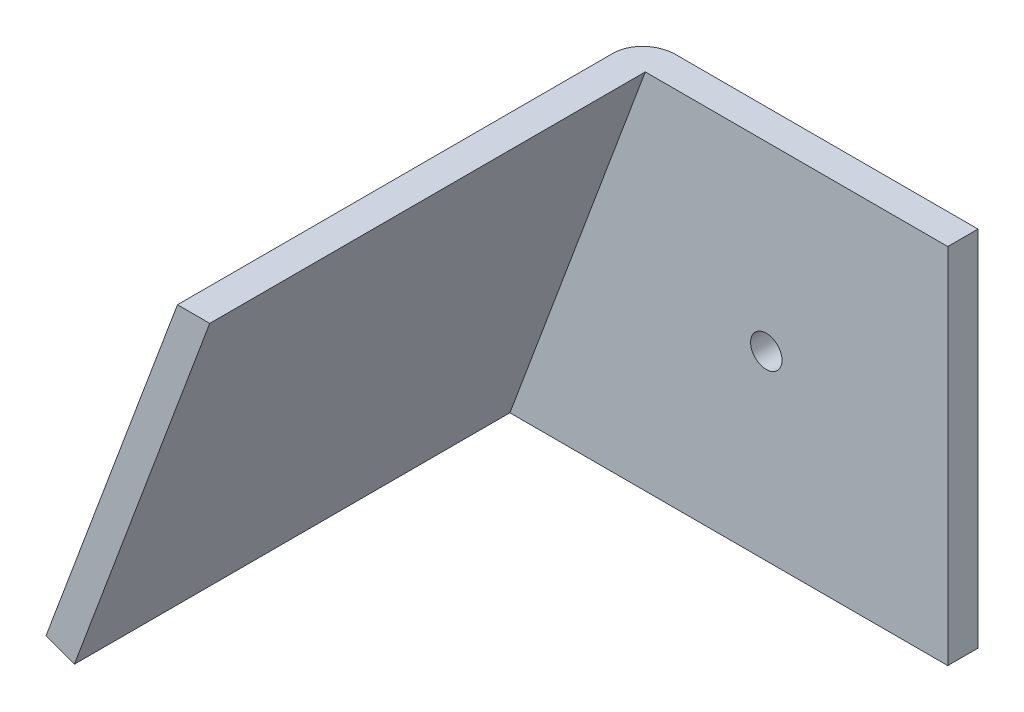
ISO-10303-21;
HEADER;
FILE_DESCRIPTION(('STEP AP214'),'2;1');
FILE_NAME('part.step','',(''),(''),'','','');
FILE_SCHEMA(('AUTOMOTIVE_DESIGN { 1 0 10303 214 1 1 1 1 }'));
ENDSEC;
DATA;
#1=APPLICATION_CONTEXT('core data for automotive mechanical design processes');
#2=APPLICATION_PROTOCOL_DEFINITION('international standard','automotive_design',2000,#1);
#3=PRODUCT_CONTEXT('',#1,'mechanical');
#4=PRODUCT('Part','Part','',(#3));
#5=PRODUCT_RELATED_PRODUCT_CATEGORY('part','',(#4));
#6=PRODUCT_DEFINITION_FORMATION('','',#4);
#7=PRODUCT_DEFINITION_CONTEXT('part definition',#1,'design');
#8=PRODUCT_DEFINITION('design','',#6,#7);
#9=PRODUCT_DEFINITION_SHAPE('','',#8);
#10=(LENGTH_UNIT() NAMED_UNIT(*) SI_UNIT(.MILLI.,.METRE.));
#11=(NAMED_UNIT(*) PLANE_ANGLE_UNIT() SI_UNIT($,.RADIAN.));
#12=(NAMED_UNIT(*) SI_UNIT($,.STERADIAN.) SOLID_ANGLE_UNIT());
#13=UNCERTAINTY_MEASURE_WITH_UNIT(LENGTH_MEASURE(1.E-05),#10,'distance_accuracy_value','');
#14=(GEOMETRIC_REPRESENTATION_CONTEXT(3) GLOBAL_UNCERTAINTY_ASSIGNED_CONTEXT((#13)) GLOBAL_UNIT_ASSIGNED_CONTEXT((#10,
#11,#12)) REPRESENTATION_CONTEXT('',''));
#15=CARTESIAN_POINT('',(0.,0.,0.));
#16=DIRECTION('',(0.,0.,1.));
#17=DIRECTION('',(1.,0.,0.));
#18=AXIS2_PLACEMENT_3D('',#15,#16,#17);
#19=CARTESIAN_POINT('',(-31.75,0.,-3.175));
#20=DIRECTION('',(0.,1.,0.));
#21=DIRECTION('',(0.,0.,1.));
#22=AXIS2_PLACEMENT_3D('',#19,#20,#21);
#23=PLANE('',#22);
#24=DIRECTION('',(-1.,0.,0.));
#25=VECTOR('',#24,1.);
#26=CARTESIAN_POINT('',(-31.75,0.,0.));
#27=LINE('',#26,#25);
#28=CARTESIAN_POINT('',(0.,0.,0.));
#29=VERTEX_POINT('',#28);
#30=CARTESIAN_POINT('',(-31.75,0.,0.));
#31=VERTEX_POINT('',#30);
#32=EDGE_CURVE('E121',#29,#31,#27,.T.);
#33=ORIENTED_EDGE('',*,*,#32,.F.);
#34=DIRECTION('',(0.,0.,1.));
#35=VECTOR('',#34,1.);
#36=CARTESIAN_POINT('',(0.,0.,-3.175));
#37=LINE('',#36,#35);
#38=CARTESIAN_POINT('',(0.,0.,-3.175));
#39=VERTEX_POINT('',#38);
#40=EDGE_CURVE('E11',#39,#29,#37,.T.);
#41=ORIENTED_EDGE('',*,*,#40,.F.);
#42=DIRECTION('',(-1.,0.,0.));
#43=VECTOR('',#42,1.);
#44=CARTESIAN_POINT('',(-31.75,0.,-3.175));
#45=LINE('',#44,#43);
#46=CARTESIAN_POINT('',(-31.75,0.,-3.175));
#47=VERTEX_POINT('',#46);
#48=EDGE_CURVE('E119',#39,#47,#45,.T.);
#49=ORIENTED_EDGE('',*,*,#48,.T.);
#50=CARTESIAN_POINT('',(-31.75,0.,0.));
#51=DIRECTION('',(0.,-1.,0.));
#52=DIRECTION('',(1.,0.,0.));
#53=AXIS2_PLACEMENT_3D('',#50,#51,#52);
#54=ELLIPSE('',#53,3.3887760149351,3.175);
#55=CARTESIAN_POINT('',(-35.1387760149353,0.,0.));
#56=VERTEX_POINT('',#55);
#57=EDGE_CURVE('E104',#47,#56,#54,.F.);
#58=ORIENTED_EDGE('',*,*,#57,.T.);
#59=DIRECTION('',(0.,0.,1.));
#60=VECTOR('',#59,1.);
#61=CARTESIAN_POINT('',(-35.1387760149353,0.,-5.588));
#62=LINE('',#61,#60);
#63=CARTESIAN_POINT('',(-35.1387760149353,0.,45.72));
#64=VERTEX_POINT('',#63);
#65=EDGE_CURVE('E306',#56,#64,#62,.T.);
#66=ORIENTED_EDGE('',*,*,#65,.T.);
#67=DIRECTION('',(-1.,0.,0.));
#68=VECTOR('',#67,1.);
#69=CARTESIAN_POINT('',(-34.7247097345983,0.,45.72));
#70=LINE('',#69,#68);
#71=CARTESIAN_POINT('',(-31.7500000000002,0.,45.72));
#72=VERTEX_POINT('',#71);
#73=EDGE_CURVE('E112',#72,#64,#70,.T.);
#74=ORIENTED_EDGE('',*,*,#73,.F.);
#75=DIRECTION('',(0.,0.,-1.));
#76=VECTOR('',#75,1.);
#77=CARTESIAN_POINT('',(-31.75,0.,0.));
#78=LINE('',#77,#76);
#79=EDGE_CURVE('E146',#72,#31,#78,.T.);
#80=ORIENTED_EDGE('',*,*,#79,.T.);
#81=EDGE_LOOP('',(#33,#41,#49,#58,#66,#74,#80));
#82=FACE_BOUND('',#81,.T.);
#83=ADVANCED_FACE('F39',(#82),#23,.T.);
#84=CARTESIAN_POINT('',(0.,-38.1,-3.175));
#85=DIRECTION('',(1.,0.,0.));
#86=DIRECTION('',(0.,0.,-1.));
#87=AXIS2_PLACEMENT_3D('',#84,#85,#86);
#88=PLANE('',#87);
#89=DIRECTION('',(0.,1.,0.));
#90=VECTOR('',#89,1.);
#91=CARTESIAN_POINT('',(0.,-38.1,0.));
#92=LINE('',#91,#90);
#93=CARTESIAN_POINT('',(0.,-38.1,0.));
#94=VERTEX_POINT('',#93);
#95=EDGE_CURVE('E134',#94,#29,#92,.T.);
#96=ORIENTED_EDGE('',*,*,#95,.F.);
#97=DIRECTION('',(0.,0.,1.));
#98=VECTOR('',#97,1.);
#99=CARTESIAN_POINT('',(0.,-38.1,-3.175));
#100=LINE('',#99,#98);
#101=CARTESIAN_POINT('',(0.,-38.1,-3.175));
#102=VERTEX_POINT('',#101);
#103=EDGE_CURVE('E49',#102,#94,#100,.T.);
#104=ORIENTED_EDGE('',*,*,#103,.F.);
#105=DIRECTION('',(0.,1.,0.));
#106=VECTOR('',#105,1.);
#107=CARTESIAN_POINT('',(0.,-38.1,-3.175));
#108=LINE('',#107,#106);
#109=EDGE_CURVE('E123',#102,#39,#108,.T.);
#110=ORIENTED_EDGE('',*,*,#109,.T.);
#111=ORIENTED_EDGE('',*,*,#40,.T.);
#112=EDGE_LOOP('',(#96,#104,#110,#111));
#113=FACE_BOUND('',#112,.T.);
#114=ADVANCED_FACE('F181',(#113),#88,.T.);
#115=CARTESIAN_POINT('',(-45.9646971347795,-38.1,-3.175));
#116=DIRECTION('',(0.,-1.,0.));
#117=DIRECTION('',(0.,0.,-1.));
#118=AXIS2_PLACEMENT_3D('',#115,#116,#117);
#119=PLANE('',#118);
#120=DIRECTION('',(1.,0.,0.));
#121=VECTOR('',#120,1.);
#122=CARTESIAN_POINT('',(-45.9646971347795,-38.1,0.));
#123=LINE('',#122,#121);
#124=CARTESIAN_POINT('',(-45.9646971347795,-38.1,0.));
#125=VERTEX_POINT('',#124);
#126=EDGE_CURVE('E130',#125,#94,#123,.T.);
#127=ORIENTED_EDGE('',*,*,#126,.F.);
#128=DIRECTION('',(0.,0.,1.));
#129=VECTOR('',#128,1.);
#130=CARTESIAN_POINT('',(-45.9646971347795,-38.1,-3.175));
#131=LINE('',#130,#129);
#132=CARTESIAN_POINT('',(-45.9646971347795,-38.1,-3.175));
#133=VERTEX_POINT('',#132);
#134=EDGE_CURVE('E43',#133,#125,#131,.T.);
#135=ORIENTED_EDGE('',*,*,#134,.F.);
#136=DIRECTION('',(1.,0.,0.));
#137=VECTOR('',#136,1.);
#138=CARTESIAN_POINT('',(-45.9646971347795,-38.1,-3.175));
#139=LINE('',#138,#137);
#140=EDGE_CURVE('E120',#133,#102,#139,.T.);
#141=ORIENTED_EDGE('',*,*,#140,.T.);
#142=ORIENTED_EDGE('',*,*,#103,.T.);
#143=EDGE_LOOP('',(#127,#135,#141,#142));
#144=FACE_BOUND('',#143,.T.);
#145=ADVANCED_FACE('F41',(#144),#119,.T.);
#146=CARTESIAN_POINT('',(0.,0.,-3.175));
#147=DIRECTION('',(0.,0.,1.));
#148=DIRECTION('',(1.,0.,0.));
#149=AXIS2_PLACEMENT_3D('',#146,#147,#148);
#150=PLANE('',#149);
#151=CARTESIAN_POINT('',(-19.05,-19.05,-3.175));
#152=DIRECTION('',(0.,0.,1.));
#153=DIRECTION('',(1.,0.,0.));
#154=AXIS2_PLACEMENT_3D('',#151,#152,#153);
#155=CIRCLE('',#154,1.651);
#156=CARTESIAN_POINT('',(-17.399,-19.05,-3.175));
#157=VERTEX_POINT('',#156);
#158=EDGE_CURVE('E131',#157,#157,#155,.T.);
#159=ORIENTED_EDGE('',*,*,#158,.T.);
#160=EDGE_LOOP('',(#159));
#161=FACE_BOUND('',#160,.T.);
#162=DIRECTION('',(-0.349553375420609,-0.936916451841923,0.));
#163=VECTOR('',#162,1.);
#164=CARTESIAN_POINT('',(-31.75,0.,-3.175));
#165=LINE('',#164,#163);
#166=EDGE_CURVE('E107',#47,#133,#165,.T.);
#167=ORIENTED_EDGE('',*,*,#166,.F.);
#168=ORIENTED_EDGE('',*,*,#48,.F.);
#169=ORIENTED_EDGE('',*,*,#109,.F.);
#170=ORIENTED_EDGE('',*,*,#140,.F.);
#171=EDGE_LOOP('',(#167,#168,#169,#170));
#172=FACE_BOUND('',#171,.T.);
#173=ADVANCED_FACE('F117',(#161,#172),#150,.F.);
#174=CARTESIAN_POINT('',(0.,0.,0.));
#175=DIRECTION('',(0.,0.,1.));
#176=DIRECTION('',(1.,0.,0.));
#177=AXIS2_PLACEMENT_3D('',#174,#175,#176);
#178=PLANE('',#177);
#179=CARTESIAN_POINT('',(-19.05,-19.05,0.));
#180=DIRECTION('',(0.,0.,1.));
#181=DIRECTION('',(1.,0.,0.));
#182=AXIS2_PLACEMENT_3D('',#179,#180,#181);
#183=CIRCLE('',#182,1.651);
#184=CARTESIAN_POINT('',(-17.399,-19.05,0.));
#185=VERTEX_POINT('',#184);
#186=EDGE_CURVE('E160',#185,#185,#183,.T.);
#187=ORIENTED_EDGE('',*,*,#186,.F.);
#188=EDGE_LOOP('',(#187));
#189=FACE_BOUND('',#188,.T.);
#190=DIRECTION('',(-0.349553375420609,-0.936916451841923,0.));
#191=VECTOR('',#190,1.);
#192=CARTESIAN_POINT('',(-31.75,0.,0.));
#193=LINE('',#192,#191);
#194=EDGE_CURVE('E128',#31,#125,#193,.T.);
#195=ORIENTED_EDGE('',*,*,#194,.T.);
#196=ORIENTED_EDGE('',*,*,#126,.T.);
#197=ORIENTED_EDGE('',*,*,#95,.T.);
#198=ORIENTED_EDGE('',*,*,#32,.T.);
#199=EDGE_LOOP('',(#195,#196,#197,#198));
#200=FACE_BOUND('',#199,.T.);
#201=ADVANCED_FACE('F140',(#189,#200),#178,.T.);
#202=CARTESIAN_POINT('',(-19.05,-19.05,-3.175));
#203=DIRECTION('',(0.,0.,1.));
#204=DIRECTION('',(1.,0.,0.));
#205=AXIS2_PLACEMENT_3D('',#202,#203,#204);
#206=CYLINDRICAL_SURFACE('',#205,1.651);
#207=ORIENTED_EDGE('',*,*,#158,.F.);
#208=EDGE_LOOP('',(#207));
#209=FACE_BOUND('',#208,.T.);
#210=ORIENTED_EDGE('',*,*,#186,.T.);
#211=EDGE_LOOP('',(#210));
#212=FACE_BOUND('',#211,.T.);
#213=ADVANCED_FACE('F171',(#209,#212),#206,.F.);
#214=CARTESIAN_POINT('',(-45.9646971347795,-38.1,-3.175));
#215=DIRECTION('',(-0.349553375420609,-0.936916451841923,0.));
#216=DIRECTION('',(0.936916451841923,-0.349553375420609,0.));
#217=AXIS2_PLACEMENT_3D('',#214,#215,#216);
#218=PLANE('',#217);
#219=CARTESIAN_POINT('',(-45.9646971347795,-38.1,0.));
#220=DIRECTION('',(0.349553375420609,0.936916451841923,0.));
#221=DIRECTION('',(-0.936916451841923,0.349553375420609,0.));
#222=AXIS2_PLACEMENT_3D('',#219,#220,#221);
#223=CIRCLE('',#222,3.175);
#224=CARTESIAN_POINT('',(-48.9394068693776,-36.9901680330396,0.));
#225=VERTEX_POINT('',#224);
#226=EDGE_CURVE('E74',#133,#225,#223,.T.);
#227=ORIENTED_EDGE('',*,*,#226,.F.);
#228=ORIENTED_EDGE('',*,*,#134,.T.);
#229=DIRECTION('',(0.936916451841923,-0.349553375420609,0.));
#230=VECTOR('',#229,1.);
#231=CARTESIAN_POINT('',(-48.9394068693776,-36.9901680330396,0.));
#232=LINE('',#231,#230);
#233=EDGE_CURVE('E155',#225,#125,#232,.T.);
#234=ORIENTED_EDGE('',*,*,#233,.F.);
#235=EDGE_LOOP('',(#227,#228,#234));
#236=FACE_BOUND('',#235,.T.);
#237=ADVANCED_FACE('F169',(#236),#218,.T.);
#238=CARTESIAN_POINT('',(-31.75,0.,0.));
#239=DIRECTION('',(0.349553375420609,0.936916451841923,0.));
#240=DIRECTION('',(-0.936916451841923,0.349553375420609,0.));
#241=AXIS2_PLACEMENT_3D('',#238,#239,#240);
#242=CYLINDRICAL_SURFACE('',#241,3.175);
#243=ORIENTED_EDGE('',*,*,#57,.F.);
#244=ORIENTED_EDGE('',*,*,#166,.T.);
#245=ORIENTED_EDGE('',*,*,#226,.T.);
#246=DIRECTION('',(-0.349553375420609,-0.936916451841923,0.));
#247=VECTOR('',#246,1.);
#248=CARTESIAN_POINT('',(-34.7247097345981,1.10983196696044,0.));
#249=LINE('',#248,#247);
#250=EDGE_CURVE('E109',#56,#225,#249,.T.);
#251=ORIENTED_EDGE('',*,*,#250,.F.);
#252=EDGE_LOOP('',(#243,#244,#245,#251));
#253=FACE_BOUND('',#252,.T.);
#254=ADVANCED_FACE('F106',(#253),#242,.T.);
#255=CARTESIAN_POINT('',(-48.9394068693778,-36.9901680330395,45.72));
#256=DIRECTION('',(0.349553375420609,0.936916451841923,0.));
#257=DIRECTION('',(-0.936916451841923,0.349553375420609,0.));
#258=AXIS2_PLACEMENT_3D('',#255,#256,#257);
#259=PLANE('',#258);
#260=DIRECTION('',(0.,0.,1.));
#261=VECTOR('',#260,1.);
#262=CARTESIAN_POINT('',(-45.9646971347797,-38.0999999999999,45.72));
#263=LINE('',#262,#261);
#264=CARTESIAN_POINT('',(-45.9646971347797,-38.0999999999999,45.72));
#265=VERTEX_POINT('',#264);
#266=EDGE_CURVE('E111',#125,#265,#263,.T.);
#267=ORIENTED_EDGE('',*,*,#266,.T.);
#268=DIRECTION('',(0.936916451841923,-0.349553375420609,0.));
#269=VECTOR('',#268,1.);
#270=CARTESIAN_POINT('',(-48.9394068693778,-36.9901680330395,45.72));
#271=LINE('',#270,#269);
#272=CARTESIAN_POINT('',(-48.9394068693778,-36.9901680330395,45.72));
#273=VERTEX_POINT('',#272);
#274=EDGE_CURVE('E158',#273,#265,#271,.T.);
#275=ORIENTED_EDGE('',*,*,#274,.F.);
#276=DIRECTION('',(0.,0.,1.));
#277=VECTOR('',#276,1.);
#278=CARTESIAN_POINT('',(-48.9394068693778,-36.9901680330395,45.72));
#279=LINE('',#278,#277);
#280=EDGE_CURVE('E157',#225,#273,#279,.T.);
#281=ORIENTED_EDGE('',*,*,#280,.F.);
#282=ORIENTED_EDGE('',*,*,#233,.T.);
#283=EDGE_LOOP('',(#267,#275,#281,#282));
#284=FACE_BOUND('',#283,.T.);
#285=ADVANCED_FACE('F156',(#284),#259,.F.);
#286=CARTESIAN_POINT('',(-34.7247097345983,1.10983196696049,45.72));
#287=DIRECTION('',(0.,0.,-1.));
#288=DIRECTION('',(-1.,0.,0.));
#289=AXIS2_PLACEMENT_3D('',#286,#287,#288);
#290=PLANE('',#289);
#291=DIRECTION('',(0.349553375420609,0.936916451841923,0.));
#292=VECTOR('',#291,1.);
#293=CARTESIAN_POINT('',(-31.7500000000002,0.,45.72));
#294=LINE('',#293,#292);
#295=EDGE_CURVE('E149',#265,#72,#294,.T.);
#296=ORIENTED_EDGE('',*,*,#295,.T.);
#297=ORIENTED_EDGE('',*,*,#73,.T.);
#298=DIRECTION('',(0.349553375420609,0.936916451841923,0.));
#299=VECTOR('',#298,1.);
#300=CARTESIAN_POINT('',(-34.7247097345983,1.10983196696049,45.72));
#301=LINE('',#300,#299);
#302=EDGE_CURVE('E162',#273,#64,#301,.T.);
#303=ORIENTED_EDGE('',*,*,#302,.F.);
#304=ORIENTED_EDGE('',*,*,#274,.T.);
#305=EDGE_LOOP('',(#296,#297,#303,#304));
#306=FACE_BOUND('',#305,.T.);
#307=ADVANCED_FACE('F238',(#306),#290,.F.);
#308=CARTESIAN_POINT('',(-30.845254632591,11.5080302532135,-1.18346270011731E-13));
#309=DIRECTION('',(0.936916451841923,-0.349553375420609,0.));
#310=DIRECTION('',(0.349553375420609,0.936916451841923,0.));
#311=AXIS2_PLACEMENT_3D('',#308,#309,#310);
#312=PLANE('',#311);
#313=ORIENTED_EDGE('',*,*,#302,.T.);
#314=ORIENTED_EDGE('',*,*,#65,.F.);
#315=ORIENTED_EDGE('',*,*,#250,.T.);
#316=ORIENTED_EDGE('',*,*,#280,.T.);
#317=EDGE_LOOP('',(#313,#314,#315,#316));
#318=FACE_BOUND('',#317,.T.);
#319=ADVANCED_FACE('F243',(#318),#312,.F.);
#320=CARTESIAN_POINT('',(-27.8705448979929,10.3981982862531,-1.07260816760904E-13));
#321=DIRECTION('',(0.936916451841923,-0.349553375420609,0.));
#322=DIRECTION('',(0.349553375420609,0.936916451841923,0.));
#323=AXIS2_PLACEMENT_3D('',#320,#321,#322);
#324=PLANE('',#323);
#325=ORIENTED_EDGE('',*,*,#194,.F.);
#326=ORIENTED_EDGE('',*,*,#79,.F.);
#327=ORIENTED_EDGE('',*,*,#295,.F.);
#328=ORIENTED_EDGE('',*,*,#266,.F.);
#329=EDGE_LOOP('',(#325,#326,#327,#328));
#330=FACE_BOUND('',#329,.T.);
#331=ADVANCED_FACE('F144',(#330),#324,.T.);
#332=CLOSED_SHELL('',(#83,#114,#145,#173,#201,#213,#237,#254,#285,#307,#319,#331));
#333=MANIFOLD_SOLID_BREP('B2',#332);
#334=ADVANCED_BREP_SHAPE_REPRESENTATION('',(#18,#333),#14);
#335=SHAPE_DEFINITION_REPRESENTATION(#9,#334);
ENDSEC;
END-ISO-10303-21;
